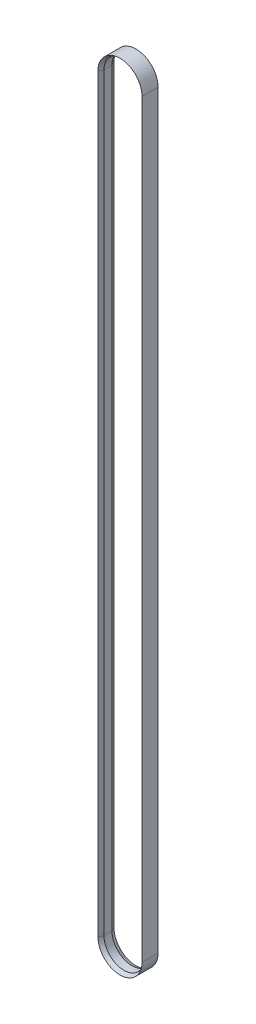
ISO-10303-21;
HEADER;
FILE_DESCRIPTION(('STEP AP214'),'2;1');
FILE_NAME('part.step','',(''),(''),'','','');
FILE_SCHEMA(('AUTOMOTIVE_DESIGN { 1 0 10303 214 1 1 1 1 }'));
ENDSEC;
DATA;
#1=APPLICATION_CONTEXT('core data for automotive mechanical design processes');
#2=APPLICATION_PROTOCOL_DEFINITION('international standard','automotive_design',2000,#1);
#3=PRODUCT_CONTEXT('',#1,'mechanical');
#4=PRODUCT('Part','Part','',(#3));
#5=PRODUCT_RELATED_PRODUCT_CATEGORY('part','',(#4));
#6=PRODUCT_DEFINITION_FORMATION('','',#4);
#7=PRODUCT_DEFINITION_CONTEXT('part definition',#1,'design');
#8=PRODUCT_DEFINITION('design','',#6,#7);
#9=PRODUCT_DEFINITION_SHAPE('','',#8);
#10=(LENGTH_UNIT() NAMED_UNIT(*) SI_UNIT(.MILLI.,.METRE.));
#11=(NAMED_UNIT(*) PLANE_ANGLE_UNIT() SI_UNIT($,.RADIAN.));
#12=(NAMED_UNIT(*) SI_UNIT($,.STERADIAN.) SOLID_ANGLE_UNIT());
#13=UNCERTAINTY_MEASURE_WITH_UNIT(LENGTH_MEASURE(1.E-05),#10,'distance_accuracy_value','');
#14=(GEOMETRIC_REPRESENTATION_CONTEXT(3) GLOBAL_UNCERTAINTY_ASSIGNED_CONTEXT((#13)) GLOBAL_UNIT_ASSIGNED_CONTEXT((#10,
#11,#12)) REPRESENTATION_CONTEXT('',''));
#15=CARTESIAN_POINT('',(0.,0.,0.));
#16=DIRECTION('',(0.,0.,1.));
#17=DIRECTION('',(1.,0.,0.));
#18=AXIS2_PLACEMENT_3D('',#15,#16,#17);
#19=CARTESIAN_POINT('',(27.5,-935.499999999842,10.));
#20=DIRECTION('',(1.,0.,0.));
#21=DIRECTION('',(0.,0.,-1.));
#22=AXIS2_PLACEMENT_3D('',#19,#20,#21);
#23=PLANE('',#22);
#24=DIRECTION('',(0.,1.,0.));
#25=VECTOR('',#24,1.);
#26=CARTESIAN_POINT('',(27.5,-935.499999999842,10.));
#27=LINE('',#26,#25);
#28=CARTESIAN_POINT('',(27.5,-935.499999999844,10.));
#29=VERTEX_POINT('',#28);
#30=CARTESIAN_POINT('',(27.5,0.,10.));
#31=VERTEX_POINT('',#30);
#32=EDGE_CURVE('E11',#29,#31,#27,.T.);
#33=ORIENTED_EDGE('',*,*,#32,.F.);
#34=DIRECTION('',(0.,0.,-1.));
#35=VECTOR('',#34,1.);
#36=CARTESIAN_POINT('',(27.5,-935.499999999844,10.));
#37=LINE('',#36,#35);
#38=CARTESIAN_POINT('',(27.5,-935.499999999844,-10.));
#39=VERTEX_POINT('',#38);
#40=EDGE_CURVE('E42',#29,#39,#37,.T.);
#41=ORIENTED_EDGE('',*,*,#40,.T.);
#42=DIRECTION('',(0.,1.,0.));
#43=VECTOR('',#42,1.);
#44=CARTESIAN_POINT('',(27.5,-935.499999999842,-10.));
#45=LINE('',#44,#43);
#46=CARTESIAN_POINT('',(27.5,0.,-10.));
#47=VERTEX_POINT('',#46);
#48=EDGE_CURVE('E127',#39,#47,#45,.T.);
#49=ORIENTED_EDGE('',*,*,#48,.T.);
#50=DIRECTION('',(0.,0.,-1.));
#51=VECTOR('',#50,1.);
#52=CARTESIAN_POINT('',(27.5,0.,10.));
#53=LINE('',#52,#51);
#54=EDGE_CURVE('E130',#31,#47,#53,.T.);
#55=ORIENTED_EDGE('',*,*,#54,.F.);
#56=EDGE_LOOP('',(#33,#41,#49,#55));
#57=FACE_BOUND('',#56,.T.);
#58=ADVANCED_FACE('F39',(#57),#23,.T.);
#59=CARTESIAN_POINT('',(25.,-935.499999999842,5.));
#60=DIRECTION('',(-0.894427190999916,0.,0.447213595499958));
#61=DIRECTION('',(0.447213595499958,0.,0.894427190999916));
#62=AXIS2_PLACEMENT_3D('',#59,#60,#61);
#63=PLANE('',#62);
#64=DIRECTION('',(0.,1.,0.));
#65=VECTOR('',#64,1.);
#66=CARTESIAN_POINT('',(25.,-935.499999999842,5.));
#67=LINE('',#66,#65);
#68=CARTESIAN_POINT('',(25.,-935.499999999844,5.));
#69=VERTEX_POINT('',#68);
#70=CARTESIAN_POINT('',(25.,0.,5.));
#71=VERTEX_POINT('',#70);
#72=EDGE_CURVE('E47',#69,#71,#67,.T.);
#73=ORIENTED_EDGE('',*,*,#72,.F.);
#74=DIRECTION('',(0.447213595499958,0.,0.894427190999916));
#75=VECTOR('',#74,1.);
#76=CARTESIAN_POINT('',(25.,-935.499999999844,5.));
#77=LINE('',#76,#75);
#78=EDGE_CURVE('E197',#69,#29,#77,.T.);
#79=ORIENTED_EDGE('',*,*,#78,.T.);
#80=ORIENTED_EDGE('',*,*,#32,.T.);
#81=DIRECTION('',(0.447213595499958,0.,0.894427190999916));
#82=VECTOR('',#81,1.);
#83=CARTESIAN_POINT('',(25.,0.,5.));
#84=LINE('',#83,#82);
#85=EDGE_CURVE('E155',#71,#31,#84,.T.);
#86=ORIENTED_EDGE('',*,*,#85,.F.);
#87=EDGE_LOOP('',(#73,#79,#80,#86));
#88=FACE_BOUND('',#87,.T.);
#89=ADVANCED_FACE('F221',(#88),#63,.T.);
#90=CARTESIAN_POINT('',(25.,-935.499999999842,-5.));
#91=DIRECTION('',(-1.,0.,0.));
#92=DIRECTION('',(0.,0.,1.));
#93=AXIS2_PLACEMENT_3D('',#90,#91,#92);
#94=PLANE('',#93);
#95=DIRECTION('',(0.,1.,0.));
#96=VECTOR('',#95,1.);
#97=CARTESIAN_POINT('',(25.,-935.499999999842,-5.));
#98=LINE('',#97,#96);
#99=CARTESIAN_POINT('',(25.,-935.499999999844,-5.));
#100=VERTEX_POINT('',#99);
#101=CARTESIAN_POINT('',(25.,0.,-5.));
#102=VERTEX_POINT('',#101);
#103=EDGE_CURVE('E136',#100,#102,#98,.T.);
#104=ORIENTED_EDGE('',*,*,#103,.F.);
#105=DIRECTION('',(0.,0.,1.));
#106=VECTOR('',#105,1.);
#107=CARTESIAN_POINT('',(25.,-935.499999999844,-5.));
#108=LINE('',#107,#106);
#109=EDGE_CURVE('E181',#100,#69,#108,.T.);
#110=ORIENTED_EDGE('',*,*,#109,.T.);
#111=ORIENTED_EDGE('',*,*,#72,.T.);
#112=DIRECTION('',(0.,0.,1.));
#113=VECTOR('',#112,1.);
#114=CARTESIAN_POINT('',(25.,0.,-5.));
#115=LINE('',#114,#113);
#116=EDGE_CURVE('E159',#102,#71,#115,.T.);
#117=ORIENTED_EDGE('',*,*,#116,.F.);
#118=EDGE_LOOP('',(#104,#110,#111,#117));
#119=FACE_BOUND('',#118,.T.);
#120=ADVANCED_FACE('F226',(#119),#94,.T.);
#121=CARTESIAN_POINT('',(7.94919685631612E-11,-935.499999999874,0.));
#122=DIRECTION('',(0.,0.,1.));
#123=DIRECTION('',(1.,0.,0.));
#124=AXIS2_PLACEMENT_3D('',#121,#122,#123);
#125=CYLINDRICAL_SURFACE('',#124,27.4999999999205);
#126=ORIENTED_EDGE('',*,*,#40,.F.);
#127=CARTESIAN_POINT('',(7.94919685631612E-11,-935.499999999874,10.));
#128=DIRECTION('',(0.,0.,1.));
#129=DIRECTION('',(-1.,-1.09811150072333E-12,0.));
#130=AXIS2_PLACEMENT_3D('',#127,#128,#129);
#131=CIRCLE('',#130,27.4999999999205);
#132=CARTESIAN_POINT('',(-27.5,-935.499999999904,10.));
#133=VERTEX_POINT('',#132);
#134=EDGE_CURVE('E83',#133,#29,#131,.T.);
#135=ORIENTED_EDGE('',*,*,#134,.F.);
#136=DIRECTION('',(0.,0.,-1.));
#137=VECTOR('',#136,1.);
#138=CARTESIAN_POINT('',(-27.499999999841,-935.499999999904,10.));
#139=LINE('',#138,#137);
#140=CARTESIAN_POINT('',(-27.5,-935.499999999904,-10.));
#141=VERTEX_POINT('',#140);
#142=EDGE_CURVE('E184',#133,#141,#139,.T.);
#143=ORIENTED_EDGE('',*,*,#142,.T.);
#144=CARTESIAN_POINT('',(7.94919685631612E-11,-935.499999999874,-10.));
#145=DIRECTION('',(0.,0.,1.));
#146=DIRECTION('',(-1.,-1.09811150072333E-12,0.));
#147=AXIS2_PLACEMENT_3D('',#144,#145,#146);
#148=CIRCLE('',#147,27.4999999999205);
#149=EDGE_CURVE('E179',#141,#39,#148,.T.);
#150=ORIENTED_EDGE('',*,*,#149,.T.);
#151=EDGE_LOOP('',(#126,#135,#143,#150));
#152=FACE_BOUND('',#151,.T.);
#153=ADVANCED_FACE('F210',(#152),#125,.T.);
#154=CARTESIAN_POINT('',(7.94919685631612E-11,-935.499999999874,5.));
#155=DIRECTION('',(0.,0.,1.));
#156=DIRECTION('',(1.,0.,0.));
#157=AXIS2_PLACEMENT_3D('',#154,#155,#156);
#158=CONICAL_SURFACE('',#157,24.9999999999205,0.463647609000806);
#159=ORIENTED_EDGE('',*,*,#134,.T.);
#160=ORIENTED_EDGE('',*,*,#78,.F.);
#161=CARTESIAN_POINT('',(7.94919685631612E-11,-935.499999999874,5.));
#162=DIRECTION('',(0.,0.,1.));
#163=DIRECTION('',(-1.,-1.21236354289453E-12,0.));
#164=AXIS2_PLACEMENT_3D('',#161,#162,#163);
#165=CIRCLE('',#164,24.9999999999205);
#166=CARTESIAN_POINT('',(-25.,-935.499999999904,5.));
#167=VERTEX_POINT('',#166);
#168=EDGE_CURVE('E92',#167,#69,#165,.T.);
#169=ORIENTED_EDGE('',*,*,#168,.F.);
#170=DIRECTION('',(-0.447213595499958,0.,0.894427190999916));
#171=VECTOR('',#170,1.);
#172=CARTESIAN_POINT('',(-24.999999999841,-935.499999999904,5.));
#173=LINE('',#172,#171);
#174=EDGE_CURVE('E193',#167,#133,#173,.T.);
#175=ORIENTED_EDGE('',*,*,#174,.T.);
#176=EDGE_LOOP('',(#159,#160,#169,#175));
#177=FACE_BOUND('',#176,.T.);
#178=ADVANCED_FACE('F220',(#177),#158,.F.);
#179=CARTESIAN_POINT('',(7.94919685631612E-11,-935.499999999874,0.));
#180=DIRECTION('',(0.,0.,1.));
#181=DIRECTION('',(1.,0.,0.));
#182=AXIS2_PLACEMENT_3D('',#179,#180,#181);
#183=CYLINDRICAL_SURFACE('',#182,24.9999999999205);
#184=ORIENTED_EDGE('',*,*,#168,.T.);
#185=ORIENTED_EDGE('',*,*,#109,.F.);
#186=CARTESIAN_POINT('',(7.94919685631612E-11,-935.499999999874,-5.));
#187=DIRECTION('',(0.,0.,1.));
#188=DIRECTION('',(-1.,-1.21236354289453E-12,0.));
#189=AXIS2_PLACEMENT_3D('',#186,#187,#188);
#190=CIRCLE('',#189,24.9999999999205);
#191=CARTESIAN_POINT('',(-25.,-935.499999999904,-5.));
#192=VERTEX_POINT('',#191);
#193=EDGE_CURVE('E100',#192,#100,#190,.T.);
#194=ORIENTED_EDGE('',*,*,#193,.F.);
#195=DIRECTION('',(0.,0.,1.));
#196=VECTOR('',#195,1.);
#197=CARTESIAN_POINT('',(-24.999999999841,-935.499999999904,-5.));
#198=LINE('',#197,#196);
#199=EDGE_CURVE('E173',#192,#167,#198,.T.);
#200=ORIENTED_EDGE('',*,*,#199,.T.);
#201=EDGE_LOOP('',(#184,#185,#194,#200));
#202=FACE_BOUND('',#201,.T.);
#203=ADVANCED_FACE('F227',(#202),#183,.F.);
#204=CARTESIAN_POINT('',(7.94919685631612E-11,-935.499999999874,-10.));
#205=DIRECTION('',(0.,0.,-1.));
#206=DIRECTION('',(-1.,0.,0.));
#207=AXIS2_PLACEMENT_3D('',#204,#205,#206);
#208=CONICAL_SURFACE('',#207,27.4999999999205,0.463647609000806);
#209=ORIENTED_EDGE('',*,*,#193,.T.);
#210=DIRECTION('',(-0.447213595499958,0.,0.894427190999916));
#211=VECTOR('',#210,1.);
#212=CARTESIAN_POINT('',(27.5,-935.499999999844,-10.));
#213=LINE('',#212,#211);
#214=EDGE_CURVE('E177',#39,#100,#213,.T.);
#215=ORIENTED_EDGE('',*,*,#214,.F.);
#216=ORIENTED_EDGE('',*,*,#149,.F.);
#217=DIRECTION('',(0.447213595499958,0.,0.894427190999916));
#218=VECTOR('',#217,1.);
#219=CARTESIAN_POINT('',(-27.499999999841,-935.499999999904,-10.));
#220=LINE('',#219,#218);
#221=EDGE_CURVE('E168',#141,#192,#220,.T.);
#222=ORIENTED_EDGE('',*,*,#221,.T.);
#223=EDGE_LOOP('',(#209,#215,#216,#222));
#224=FACE_BOUND('',#223,.T.);
#225=ADVANCED_FACE('F228',(#224),#208,.F.);
#226=CARTESIAN_POINT('',(-27.5,2.25593607641454E-12,10.));
#227=DIRECTION('',(-1.,0.,0.));
#228=DIRECTION('',(0.,0.,1.));
#229=AXIS2_PLACEMENT_3D('',#226,#227,#228);
#230=PLANE('',#229);
#231=ORIENTED_EDGE('',*,*,#142,.F.);
#232=DIRECTION('',(0.,-1.,0.));
#233=VECTOR('',#232,1.);
#234=CARTESIAN_POINT('',(-27.5,2.25593607641454E-12,10.));
#235=LINE('',#234,#233);
#236=CARTESIAN_POINT('',(-27.499999999841,2.25601029548069E-12,10.));
#237=VERTEX_POINT('',#236);
#238=EDGE_CURVE('E203',#237,#133,#235,.T.);
#239=ORIENTED_EDGE('',*,*,#238,.F.);
#240=DIRECTION('',(0.,0.,-1.));
#241=VECTOR('',#240,1.);
#242=CARTESIAN_POINT('',(-27.5,2.25593607641454E-12,10.));
#243=LINE('',#242,#241);
#244=CARTESIAN_POINT('',(-27.499999999841,2.25601029548069E-12,-10.));
#245=VERTEX_POINT('',#244);
#246=EDGE_CURVE('E176',#237,#245,#243,.T.);
#247=ORIENTED_EDGE('',*,*,#246,.T.);
#248=DIRECTION('',(0.,-1.,0.));
#249=VECTOR('',#248,1.);
#250=CARTESIAN_POINT('',(-27.5,2.25593607641454E-12,-10.));
#251=LINE('',#250,#249);
#252=EDGE_CURVE('E171',#245,#141,#251,.T.);
#253=ORIENTED_EDGE('',*,*,#252,.T.);
#254=EDGE_LOOP('',(#231,#239,#247,#253));
#255=FACE_BOUND('',#254,.T.);
#256=ADVANCED_FACE('F215',(#255),#230,.T.);
#257=CARTESIAN_POINT('',(-25.,2.05085097855867E-12,5.));
#258=DIRECTION('',(0.894427190999916,0.,0.447213595499958));
#259=DIRECTION('',(0.447213595499958,0.,-0.894427190999916));
#260=AXIS2_PLACEMENT_3D('',#257,#258,#259);
#261=PLANE('',#260);
#262=ORIENTED_EDGE('',*,*,#238,.T.);
#263=ORIENTED_EDGE('',*,*,#174,.F.);
#264=DIRECTION('',(0.,-1.,0.));
#265=VECTOR('',#264,1.);
#266=CARTESIAN_POINT('',(-25.,2.05085097855867E-12,5.));
#267=LINE('',#266,#265);
#268=CARTESIAN_POINT('',(-24.999999999841,2.04587198210925E-12,5.));
#269=VERTEX_POINT('',#268);
#270=EDGE_CURVE('E112',#269,#167,#267,.T.);
#271=ORIENTED_EDGE('',*,*,#270,.F.);
#272=DIRECTION('',(-0.447213595499958,0.,0.894427190999916));
#273=VECTOR('',#272,1.);
#274=CARTESIAN_POINT('',(-25.,2.05085097855867E-12,5.));
#275=LINE('',#274,#273);
#276=EDGE_CURVE('E190',#269,#237,#275,.T.);
#277=ORIENTED_EDGE('',*,*,#276,.T.);
#278=EDGE_LOOP('',(#262,#263,#271,#277));
#279=FACE_BOUND('',#278,.T.);
#280=ADVANCED_FACE('F219',(#279),#261,.T.);
#281=CARTESIAN_POINT('',(-25.,2.05085097855867E-12,-5.));
#282=DIRECTION('',(1.,0.,0.));
#283=DIRECTION('',(0.,0.,-1.));
#284=AXIS2_PLACEMENT_3D('',#281,#282,#283);
#285=PLANE('',#284);
#286=ORIENTED_EDGE('',*,*,#270,.T.);
#287=ORIENTED_EDGE('',*,*,#199,.F.);
#288=DIRECTION('',(0.,-1.,0.));
#289=VECTOR('',#288,1.);
#290=CARTESIAN_POINT('',(-25.,2.05085097855867E-12,-5.));
#291=LINE('',#290,#289);
#292=CARTESIAN_POINT('',(-24.999999999841,2.04587198210925E-12,-5.));
#293=VERTEX_POINT('',#292);
#294=EDGE_CURVE('E118',#293,#192,#291,.T.);
#295=ORIENTED_EDGE('',*,*,#294,.F.);
#296=DIRECTION('',(0.,0.,1.));
#297=VECTOR('',#296,1.);
#298=CARTESIAN_POINT('',(-25.,2.05085097855867E-12,-5.));
#299=LINE('',#298,#297);
#300=EDGE_CURVE('E166',#293,#269,#299,.T.);
#301=ORIENTED_EDGE('',*,*,#300,.T.);
#302=EDGE_LOOP('',(#286,#287,#295,#301));
#303=FACE_BOUND('',#302,.T.);
#304=ADVANCED_FACE('F284',(#303),#285,.T.);
#305=CARTESIAN_POINT('',(-27.5,2.25593607641454E-12,-10.));
#306=DIRECTION('',(0.894427190999916,0.,-0.447213595499958));
#307=DIRECTION('',(-0.447213595499958,0.,-0.894427190999916));
#308=AXIS2_PLACEMENT_3D('',#305,#306,#307);
#309=PLANE('',#308);
#310=ORIENTED_EDGE('',*,*,#294,.T.);
#311=ORIENTED_EDGE('',*,*,#221,.F.);
#312=ORIENTED_EDGE('',*,*,#252,.F.);
#313=DIRECTION('',(0.447213595499958,0.,0.894427190999916));
#314=VECTOR('',#313,1.);
#315=CARTESIAN_POINT('',(-27.5,2.25593607641454E-12,-10.));
#316=LINE('',#315,#314);
#317=EDGE_CURVE('E147',#245,#293,#316,.T.);
#318=ORIENTED_EDGE('',*,*,#317,.T.);
#319=EDGE_LOOP('',(#310,#311,#312,#318));
#320=FACE_BOUND('',#319,.T.);
#321=ADVANCED_FACE('F213',(#320),#309,.T.);
#322=CARTESIAN_POINT('',(7.94919685631612E-11,-3.02535774210355E-11,0.));
#323=DIRECTION('',(0.,0.,1.));
#324=DIRECTION('',(1.,0.,0.));
#325=AXIS2_PLACEMENT_3D('',#322,#323,#324);
#326=CYLINDRICAL_SURFACE('',#325,27.4999999999205);
#327=ORIENTED_EDGE('',*,*,#246,.F.);
#328=CARTESIAN_POINT('',(7.94919685631612E-11,-3.02535774210355E-11,10.));
#329=DIRECTION('',(0.,0.,1.));
#330=DIRECTION('',(1.,1.10013008804083E-12,0.));
#331=AXIS2_PLACEMENT_3D('',#328,#329,#330);
#332=CIRCLE('',#331,27.4999999999205);
#333=EDGE_CURVE('E154',#31,#237,#332,.T.);
#334=ORIENTED_EDGE('',*,*,#333,.F.);
#335=ORIENTED_EDGE('',*,*,#54,.T.);
#336=CARTESIAN_POINT('',(7.94919685631612E-11,-3.02535774210355E-11,-10.));
#337=DIRECTION('',(0.,0.,1.));
#338=DIRECTION('',(1.,1.10013008804083E-12,0.));
#339=AXIS2_PLACEMENT_3D('',#336,#337,#338);
#340=CIRCLE('',#339,27.4999999999205);
#341=EDGE_CURVE('E142',#47,#245,#340,.T.);
#342=ORIENTED_EDGE('',*,*,#341,.T.);
#343=EDGE_LOOP('',(#327,#334,#335,#342));
#344=FACE_BOUND('',#343,.T.);
#345=ADVANCED_FACE('F152',(#344),#326,.T.);
#346=CARTESIAN_POINT('',(7.94919685631612E-11,-3.02535774210355E-11,5.));
#347=DIRECTION('',(0.,0.,1.));
#348=DIRECTION('',(1.,0.,0.));
#349=AXIS2_PLACEMENT_3D('',#346,#347,#348);
#350=CONICAL_SURFACE('',#349,24.9999999999205,0.463647609000806);
#351=ORIENTED_EDGE('',*,*,#333,.T.);
#352=ORIENTED_EDGE('',*,*,#276,.F.);
#353=CARTESIAN_POINT('',(7.94919685631612E-11,-3.02535774210355E-11,5.));
#354=DIRECTION('',(0.,0.,1.));
#355=DIRECTION('',(1.,1.21014309684527E-12,0.));
#356=AXIS2_PLACEMENT_3D('',#353,#354,#355);
#357=CIRCLE('',#356,24.9999999999205);
#358=EDGE_CURVE('E187',#71,#269,#357,.T.);
#359=ORIENTED_EDGE('',*,*,#358,.F.);
#360=ORIENTED_EDGE('',*,*,#85,.T.);
#361=EDGE_LOOP('',(#351,#352,#359,#360));
#362=FACE_BOUND('',#361,.T.);
#363=ADVANCED_FACE('F217',(#362),#350,.F.);
#364=CARTESIAN_POINT('',(7.94919685631612E-11,-3.02535774210355E-11,0.));
#365=DIRECTION('',(0.,0.,1.));
#366=DIRECTION('',(1.,0.,0.));
#367=AXIS2_PLACEMENT_3D('',#364,#365,#366);
#368=CYLINDRICAL_SURFACE('',#367,24.9999999999205);
#369=ORIENTED_EDGE('',*,*,#358,.T.);
#370=ORIENTED_EDGE('',*,*,#300,.F.);
#371=CARTESIAN_POINT('',(7.94919685631612E-11,-3.02535774210355E-11,-5.));
#372=DIRECTION('',(0.,0.,1.));
#373=DIRECTION('',(1.,1.21014309684527E-12,0.));
#374=AXIS2_PLACEMENT_3D('',#371,#372,#373);
#375=CIRCLE('',#374,24.9999999999205);
#376=EDGE_CURVE('E165',#102,#293,#375,.T.);
#377=ORIENTED_EDGE('',*,*,#376,.F.);
#378=ORIENTED_EDGE('',*,*,#116,.T.);
#379=EDGE_LOOP('',(#369,#370,#377,#378));
#380=FACE_BOUND('',#379,.T.);
#381=ADVANCED_FACE('F224',(#380),#368,.F.);
#382=CARTESIAN_POINT('',(7.94919685631612E-11,-3.02535774210355E-11,-10.));
#383=DIRECTION('',(0.,0.,-1.));
#384=DIRECTION('',(-1.,0.,0.));
#385=AXIS2_PLACEMENT_3D('',#382,#383,#384);
#386=CONICAL_SURFACE('',#385,27.4999999999205,0.463647609000806);
#387=ORIENTED_EDGE('',*,*,#376,.T.);
#388=ORIENTED_EDGE('',*,*,#317,.F.);
#389=ORIENTED_EDGE('',*,*,#341,.F.);
#390=DIRECTION('',(-0.447213595499958,0.,0.894427190999916));
#391=VECTOR('',#390,1.);
#392=CARTESIAN_POINT('',(27.5,0.,-10.));
#393=LINE('',#392,#391);
#394=EDGE_CURVE('E145',#47,#102,#393,.T.);
#395=ORIENTED_EDGE('',*,*,#394,.T.);
#396=EDGE_LOOP('',(#387,#388,#389,#395));
#397=FACE_BOUND('',#396,.T.);
#398=ADVANCED_FACE('F144',(#397),#386,.F.);
#399=CARTESIAN_POINT('',(27.5,-935.499999999842,-10.));
#400=DIRECTION('',(-0.894427190999916,0.,-0.447213595499958));
#401=DIRECTION('',(-0.447213595499958,0.,0.894427190999916));
#402=AXIS2_PLACEMENT_3D('',#399,#400,#401);
#403=PLANE('',#402);
#404=ORIENTED_EDGE('',*,*,#214,.T.);
#405=ORIENTED_EDGE('',*,*,#103,.T.);
#406=ORIENTED_EDGE('',*,*,#394,.F.);
#407=ORIENTED_EDGE('',*,*,#48,.F.);
#408=EDGE_LOOP('',(#404,#405,#406,#407));
#409=FACE_BOUND('',#408,.T.);
#410=ADVANCED_FACE('F157',(#409),#403,.T.);
#411=CLOSED_SHELL('',(#58,#89,#120,#153,#178,#203,#225,#256,#280,#304,#321,#345,#363,#381,#398,#410));
#412=MANIFOLD_SOLID_BREP('B2',#411);
#413=ADVANCED_BREP_SHAPE_REPRESENTATION('',(#18,#412),#14);
#414=SHAPE_DEFINITION_REPRESENTATION(#9,#413);
ENDSEC;
END-ISO-10303-21;
